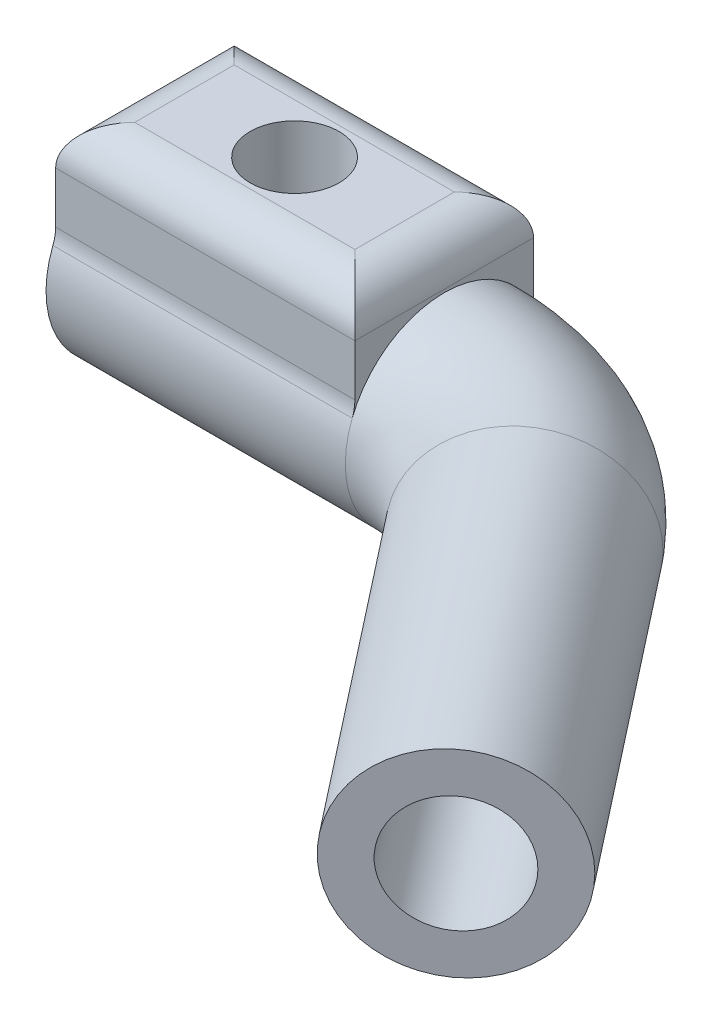
ISO-10303-21;
HEADER;
FILE_DESCRIPTION(('STEP AP214'),'2;1');
FILE_NAME('part.step','',(''),(''),'','','');
FILE_SCHEMA(('AUTOMOTIVE_DESIGN { 1 0 10303 214 1 1 1 1 }'));
ENDSEC;
DATA;
#1=APPLICATION_CONTEXT('core data for automotive mechanical design processes');
#2=APPLICATION_PROTOCOL_DEFINITION('international standard','automotive_design',2000,#1);
#3=PRODUCT_CONTEXT('',#1,'mechanical');
#4=PRODUCT('Part','Part','',(#3));
#5=PRODUCT_RELATED_PRODUCT_CATEGORY('part','',(#4));
#6=PRODUCT_DEFINITION_FORMATION('','',#4);
#7=PRODUCT_DEFINITION_CONTEXT('part definition',#1,'design');
#8=PRODUCT_DEFINITION('design','',#6,#7);
#9=PRODUCT_DEFINITION_SHAPE('','',#8);
#10=(LENGTH_UNIT() NAMED_UNIT(*) SI_UNIT(.MILLI.,.METRE.));
#11=(NAMED_UNIT(*) PLANE_ANGLE_UNIT() SI_UNIT($,.RADIAN.));
#12=(NAMED_UNIT(*) SI_UNIT($,.STERADIAN.) SOLID_ANGLE_UNIT());
#13=UNCERTAINTY_MEASURE_WITH_UNIT(LENGTH_MEASURE(1.E-05),#10,'distance_accuracy_value','');
#14=(GEOMETRIC_REPRESENTATION_CONTEXT(3) GLOBAL_UNCERTAINTY_ASSIGNED_CONTEXT((#13)) GLOBAL_UNIT_ASSIGNED_CONTEXT((#10,
#11,#12)) REPRESENTATION_CONTEXT('',''));
#15=CARTESIAN_POINT('',(0.,0.,0.));
#16=DIRECTION('',(0.,0.,1.));
#17=DIRECTION('',(1.,0.,0.));
#18=AXIS2_PLACEMENT_3D('',#15,#16,#17);
#19=CARTESIAN_POINT('',(0.,2.15,0.));
#20=DIRECTION('',(0.,1.,0.));
#21=DIRECTION('',(0.,0.,1.));
#22=AXIS2_PLACEMENT_3D('',#19,#20,#21);
#23=PLANE('',#22);
#24=DIRECTION('',(-1.,0.,0.));
#25=VECTOR('',#24,1.);
#26=CARTESIAN_POINT('',(12.5,2.15,2.16333076527839));
#27=LINE('',#26,#25);
#28=CARTESIAN_POINT('',(12.5,2.15,2.16333076527839));
#29=VERTEX_POINT('',#28);
#30=CARTESIAN_POINT('',(8.18265566248867,2.15,2.16333076527839));
#31=VERTEX_POINT('',#30);
#32=EDGE_CURVE('E155',#29,#31,#27,.T.);
#33=ORIENTED_EDGE('',*,*,#32,.T.);
#34=CARTESIAN_POINT('',(7.56418981864602,2.15,0.));
#35=DIRECTION('',(0.,1.,0.));
#36=DIRECTION('',(0.,0.,1.));
#37=AXIS2_PLACEMENT_3D('',#34,#35,#36);
#38=CIRCLE('',#37,2.25);
#39=CARTESIAN_POINT('',(8.18265566248868,2.15,-2.16333076527839));
#40=VERTEX_POINT('',#39);
#41=EDGE_CURVE('E138',#40,#31,#38,.F.);
#42=ORIENTED_EDGE('',*,*,#41,.F.);
#43=DIRECTION('',(-1.,0.,0.));
#44=VECTOR('',#43,1.);
#45=CARTESIAN_POINT('',(12.5,2.15,-2.16333076527839));
#46=LINE('',#45,#44);
#47=CARTESIAN_POINT('',(12.5,2.15,-2.16333076527839));
#48=VERTEX_POINT('',#47);
#49=EDGE_CURVE('E147',#48,#40,#46,.T.);
#50=ORIENTED_EDGE('',*,*,#49,.F.);
#51=DIRECTION('',(0.,0.,-1.));
#52=VECTOR('',#51,1.);
#53=CARTESIAN_POINT('',(12.5,2.15,-2.16333076527839));
#54=LINE('',#53,#52);
#55=EDGE_CURVE('E281',#29,#48,#54,.T.);
#56=ORIENTED_EDGE('',*,*,#55,.F.);
#57=EDGE_LOOP('',(#33,#42,#50,#56));
#58=FACE_BOUND('',#57,.T.);
#59=ADVANCED_FACE('F41',(#58),#23,.F.);
#60=CARTESIAN_POINT('',(0.,0.,0.));
#61=DIRECTION('',(1.,0.,0.));
#62=DIRECTION('',(0.,0.,-1.));
#63=AXIS2_PLACEMENT_3D('',#60,#61,#62);
#64=PLANE('',#63);
#65=DIRECTION('',(0.,-1.,0.));
#66=VECTOR('',#65,1.);
#67=CARTESIAN_POINT('',(0.,7.15,4.51414443721066));
#68=LINE('',#67,#66);
#69=CARTESIAN_POINT('',(0.,5.15,4.51414443721066));
#70=VERTEX_POINT('',#69);
#71=CARTESIAN_POINT('',(0.,2.56240555946114,4.51414443721066));
#72=VERTEX_POINT('',#71);
#73=EDGE_CURVE('E267',#70,#72,#68,.T.);
#74=ORIENTED_EDGE('',*,*,#73,.F.);
#75=DIRECTION('',(0.,0.,1.));
#76=VECTOR('',#75,1.);
#77=CARTESIAN_POINT('',(0.,5.15,-4.51414443721067));
#78=LINE('',#77,#76);
#79=CARTESIAN_POINT('',(0.,5.15,-4.51414443721067));
#80=VERTEX_POINT('',#79);
#81=EDGE_CURVE('E11',#70,#80,#78,.F.);
#82=ORIENTED_EDGE('',*,*,#81,.T.);
#83=DIRECTION('',(0.,-1.,0.));
#84=VECTOR('',#83,1.);
#85=CARTESIAN_POINT('',(0.,7.15,-4.51414443721067));
#86=LINE('',#85,#84);
#87=CARTESIAN_POINT('',(0.,2.56240555946114,-4.51414443721067));
#88=VERTEX_POINT('',#87);
#89=EDGE_CURVE('E254',#80,#88,#86,.T.);
#90=ORIENTED_EDGE('',*,*,#89,.T.);
#91=CARTESIAN_POINT('',(0.,2.56240555946114,-6.51414443721067));
#92=DIRECTION('',(1.,0.,0.));
#93=DIRECTION('',(0.,0.,-1.));
#94=AXIS2_PLACEMENT_3D('',#91,#92,#93);
#95=CIRCLE('',#94,2.);
#96=CARTESIAN_POINT('',(0.,1.83028968532938,-4.65296031229333));
#97=VERTEX_POINT('',#96);
#98=EDGE_CURVE('E197',#88,#97,#95,.T.);
#99=ORIENTED_EDGE('',*,*,#98,.T.);
#100=CARTESIAN_POINT('',(0.,0.,0.));
#101=DIRECTION('',(1.,0.,0.));
#102=DIRECTION('',(0.,0.,-1.));
#103=AXIS2_PLACEMENT_3D('',#100,#101,#102);
#104=CIRCLE('',#103,5.);
#105=CARTESIAN_POINT('',(0.,1.83028968532939,4.65296031229333));
#106=VERTEX_POINT('',#105);
#107=EDGE_CURVE('E159',#106,#97,#104,.T.);
#108=ORIENTED_EDGE('',*,*,#107,.F.);
#109=CARTESIAN_POINT('',(0.,2.56240555946114,6.51414443721066));
#110=DIRECTION('',(1.,0.,0.));
#111=DIRECTION('',(0.,0.,-1.));
#112=AXIS2_PLACEMENT_3D('',#109,#110,#111);
#113=CIRCLE('',#112,2.);
#114=EDGE_CURVE('E208',#106,#72,#113,.T.);
#115=ORIENTED_EDGE('',*,*,#114,.T.);
#116=EDGE_LOOP('',(#74,#82,#90,#99,#108,#115));
#117=FACE_BOUND('',#116,.T.);
#118=CARTESIAN_POINT('',(0.,0.,0.));
#119=DIRECTION('',(-1.,0.,0.));
#120=DIRECTION('',(0.,0.,1.));
#121=AXIS2_PLACEMENT_3D('',#118,#119,#120);
#122=CIRCLE('',#121,3.05);
#123=CARTESIAN_POINT('',(0.,2.15,-2.16333076527839));
#124=VERTEX_POINT('',#123);
#125=CARTESIAN_POINT('',(0.,2.15,2.16333076527839));
#126=VERTEX_POINT('',#125);
#127=EDGE_CURVE('E164',#124,#126,#122,.T.);
#128=ORIENTED_EDGE('',*,*,#127,.F.);
#129=DIRECTION('',(0.,0.,1.));
#130=VECTOR('',#129,1.);
#131=CARTESIAN_POINT('',(0.,2.15,-4.51414443721067));
#132=LINE('',#131,#130);
#133=EDGE_CURVE('E153',#124,#126,#132,.T.);
#134=ORIENTED_EDGE('',*,*,#133,.T.);
#135=EDGE_LOOP('',(#128,#134));
#136=FACE_BOUND('',#135,.T.);
#137=ADVANCED_FACE('F288',(#117,#136),#64,.F.);
#138=CARTESIAN_POINT('',(35.4096945094416,0.,19.686069062301));
#139=DIRECTION('',(0.616387780377665,0.,0.78744276249204));
#140=DIRECTION('',(0.78744276249204,0.,-0.616387780377665));
#141=AXIS2_PLACEMENT_3D('',#138,#139,#140);
#142=PLANE('',#141);
#143=CARTESIAN_POINT('',(35.4096945094416,0.,19.686069062301));
#144=DIRECTION('',(0.616387780377665,0.,0.78744276249204));
#145=DIRECTION('',(0.78744276249204,0.,-0.616387780377665));
#146=AXIS2_PLACEMENT_3D('',#143,#144,#145);
#147=CIRCLE('',#146,2.95);
#148=CARTESIAN_POINT('',(37.7326506587931,0.,17.8677251101869));
#149=VERTEX_POINT('',#148);
#150=EDGE_CURVE('E270',#149,#149,#147,.T.);
#151=ORIENTED_EDGE('',*,*,#150,.F.);
#152=EDGE_LOOP('',(#151));
#153=FACE_BOUND('',#152,.T.);
#154=CARTESIAN_POINT('',(35.4096945094416,0.,19.686069062301));
#155=DIRECTION('',(0.616387780377665,0.,0.78744276249204));
#156=DIRECTION('',(0.78744276249204,0.,-0.616387780377665));
#157=AXIS2_PLACEMENT_3D('',#154,#155,#156);
#158=CIRCLE('',#157,5.);
#159=CARTESIAN_POINT('',(39.3469083219018,0.,16.6041301604127));
#160=VERTEX_POINT('',#159);
#161=EDGE_CURVE('E178',#160,#160,#158,.T.);
#162=ORIENTED_EDGE('',*,*,#161,.T.);
#163=EDGE_LOOP('',(#162));
#164=FACE_BOUND('',#163,.T.);
#165=ADVANCED_FACE('F290',(#153,#164),#142,.T.);
#166=CARTESIAN_POINT('',(0.,0.,0.));
#167=DIRECTION('',(1.,0.,0.));
#168=DIRECTION('',(0.,0.,-1.));
#169=AXIS2_PLACEMENT_3D('',#166,#167,#168);
#170=CYLINDRICAL_SURFACE('',#169,5.);
#171=ORIENTED_EDGE('',*,*,#107,.T.);
#172=DIRECTION('',(1.,0.,0.));
#173=VECTOR('',#172,1.);
#174=CARTESIAN_POINT('',(0.,1.83028968532938,-4.65296031229333));
#175=LINE('',#174,#173);
#176=CARTESIAN_POINT('',(15.1283796372919,1.83028968532938,-4.65296031229333));
#177=VERTEX_POINT('',#176);
#178=EDGE_CURVE('E189',#97,#177,#175,.T.);
#179=ORIENTED_EDGE('',*,*,#178,.T.);
#180=CARTESIAN_POINT('',(15.1283796372919,0.,0.));
#181=DIRECTION('',(1.,0.,0.));
#182=DIRECTION('',(0.,0.,-1.));
#183=AXIS2_PLACEMENT_3D('',#180,#181,#182);
#184=CIRCLE('',#183,5.);
#185=CARTESIAN_POINT('',(15.1283796372919,1.83028968532939,4.65296031229333));
#186=VERTEX_POINT('',#185);
#187=EDGE_CURVE('E170',#186,#177,#184,.T.);
#188=ORIENTED_EDGE('',*,*,#187,.F.);
#189=DIRECTION('',(1.,0.,0.));
#190=VECTOR('',#189,1.);
#191=CARTESIAN_POINT('',(0.,1.83028968532939,4.65296031229333));
#192=LINE('',#191,#190);
#193=EDGE_CURVE('E186',#186,#106,#192,.F.);
#194=ORIENTED_EDGE('',*,*,#193,.T.);
#195=EDGE_LOOP('',(#171,#179,#188,#194));
#196=FACE_BOUND('',#195,.T.);
#197=ADVANCED_FACE('F297',(#196),#170,.T.);
#198=CARTESIAN_POINT('',(15.1283796372919,0.,10.));
#199=DIRECTION('',(0.,-1.,0.));
#200=DIRECTION('',(0.,0.,-1.));
#201=AXIS2_PLACEMENT_3D('',#198,#199,#200);
#202=TOROIDAL_SURFACE('',#201,10.,5.);
#203=CARTESIAN_POINT('',(23.0028072622123,0.,3.83612219622335));
#204=DIRECTION('',(0.616387780377665,0.,0.78744276249204));
#205=DIRECTION('',(0.78744276249204,0.,-0.616387780377665));
#206=AXIS2_PLACEMENT_3D('',#203,#204,#205);
#207=CIRCLE('',#206,5.);
#208=CARTESIAN_POINT('',(26.9400210746725,0.,0.754183294335029));
#209=VERTEX_POINT('',#208);
#210=EDGE_CURVE('E174',#209,#209,#207,.T.);
#211=ORIENTED_EDGE('',*,*,#210,.F.);
#212=EDGE_LOOP('',(#211));
#213=FACE_BOUND('',#212,.T.);
#214=EDGE_CURVE('E171',#177,#186,#184,.T.);
#215=ORIENTED_EDGE('',*,*,#214,.T.);
#216=ORIENTED_EDGE('',*,*,#187,.T.);
#217=EDGE_LOOP('',(#215,#216));
#218=FACE_BOUND('',#217,.T.);
#219=ADVANCED_FACE('F313',(#213,#218),#202,.T.);
#220=CARTESIAN_POINT('',(23.0028072622123,0.,3.83612219622335));
#221=DIRECTION('',(0.616387780377665,0.,0.78744276249204));
#222=DIRECTION('',(0.78744276249204,0.,-0.616387780377665));
#223=AXIS2_PLACEMENT_3D('',#220,#221,#222);
#224=CYLINDRICAL_SURFACE('',#223,5.);
#225=ORIENTED_EDGE('',*,*,#161,.F.);
#226=EDGE_LOOP('',(#225));
#227=FACE_BOUND('',#226,.T.);
#228=ORIENTED_EDGE('',*,*,#210,.T.);
#229=EDGE_LOOP('',(#228));
#230=FACE_BOUND('',#229,.T.);
#231=ADVANCED_FACE('F302',(#227,#230),#224,.T.);
#232=CARTESIAN_POINT('',(12.5,0.,0.));
#233=DIRECTION('',(-1.,0.,0.));
#234=DIRECTION('',(0.,0.,1.));
#235=AXIS2_PLACEMENT_3D('',#232,#233,#234);
#236=CYLINDRICAL_SURFACE('',#235,3.05);
#237=CARTESIAN_POINT('',(6.94572397480338,2.15,2.16333076527839));
#238=VERTEX_POINT('',#237);
#239=EDGE_CURVE('E161',#238,#126,#27,.T.);
#240=ORIENTED_EDGE('',*,*,#239,.F.);
#241=CARTESIAN_POINT('',(8.18265566248867,2.15,2.16333076527839));
#242=CARTESIAN_POINT('',(8.13982369720837,2.13767974367358,2.17557396166856));
#243=CARTESIAN_POINT('',(8.09636795681791,2.12635543925523,2.18662120503574));
#244=CARTESIAN_POINT('',(8.00831118588735,2.10603876580373,2.20619557820886));
#245=CARTESIAN_POINT('',(7.96370900241831,2.09704885395342,2.21472005385568));
#246=CARTESIAN_POINT('',(7.82879734546365,2.07418290831492,2.23622999215727));
#247=CARTESIAN_POINT('',(7.7370726310703,2.06431707738953,2.24524194456994));
#248=CARTESIAN_POINT('',(7.55222126268958,2.05707748638961,2.25188012805324));
#249=CARTESIAN_POINT('',(7.45908962063703,2.059774456072,2.24944189285532));
#250=CARTESIAN_POINT('',(7.27510229776286,2.07729987196947,2.23325997608356));
#251=CARTESIAN_POINT('',(7.18424402017978,2.09211375819944,2.21952986299983));
#252=CARTESIAN_POINT('',(7.07030616779168,2.11737991023387,2.19528124516197));
#253=CARTESIAN_POINT('',(7.04508952180657,2.12341119609185,2.18945272479026));
#254=CARTESIAN_POINT('',(6.99509175370004,2.13618686647158,2.17699026009721));
#255=CARTESIAN_POINT('',(6.97030990223976,2.14292988974252,2.17035784979548));
#256=CARTESIAN_POINT('',(6.94572397480338,2.15,2.16333076527839));
#257=B_SPLINE_CURVE_WITH_KNOTS('',3,(#241,#242,#243,#244,#245,#246,#247,#248,#249,#250,#251,
#252,#253,#254,#255,#256),.UNSPECIFIED.,.F.,.F.,(4,2,2,2,2,2,2,4),(0.,0.138608579889265,
0.277362473174993,0.55387360306665,0.831943392392581,1.10967953623802,1.18939155284372,
1.26895378579073),.UNSPECIFIED.);
#258=EDGE_CURVE('E59',#31,#238,#257,.T.);
#259=ORIENTED_EDGE('',*,*,#258,.F.);
#260=ORIENTED_EDGE('',*,*,#32,.F.);
#261=CARTESIAN_POINT('',(12.5,0.,0.));
#262=DIRECTION('',(-1.,0.,0.));
#263=DIRECTION('',(0.,0.,1.));
#264=AXIS2_PLACEMENT_3D('',#261,#262,#263);
#265=CIRCLE('',#264,3.05);
#266=EDGE_CURVE('E278',#48,#29,#265,.T.);
#267=ORIENTED_EDGE('',*,*,#266,.F.);
#268=ORIENTED_EDGE('',*,*,#49,.T.);
#269=CARTESIAN_POINT('',(6.94572397480337,2.15,-2.16333076527839));
#270=CARTESIAN_POINT('',(6.98855594008367,2.13767974367358,-2.17557396166856));
#271=CARTESIAN_POINT('',(7.03201168047413,2.12635543925523,-2.18662120503574));
#272=CARTESIAN_POINT('',(7.12006845140469,2.10603876580373,-2.20619557820886));
#273=CARTESIAN_POINT('',(7.16467063487373,2.09704885395342,-2.21472005385568));
#274=CARTESIAN_POINT('',(7.29958229182839,2.07418290831491,-2.23622999215727));
#275=CARTESIAN_POINT('',(7.39130700622174,2.06431707738953,-2.24524194456995));
#276=CARTESIAN_POINT('',(7.57615837460246,2.0570774863896,-2.25188012805324));
#277=CARTESIAN_POINT('',(7.66929001665501,2.059774456072,-2.24944189285532));
#278=CARTESIAN_POINT('',(7.85327733952918,2.07729987196947,-2.23325997608356));
#279=CARTESIAN_POINT('',(7.94413561711225,2.09211375819944,-2.21952986299984));
#280=CARTESIAN_POINT('',(8.05807346950036,2.11737991023386,-2.19528124516197));
#281=CARTESIAN_POINT('',(8.08329011548547,2.12341119609184,-2.18945272479027));
#282=CARTESIAN_POINT('',(8.13328788359201,2.13618686647158,-2.17699026009721));
#283=CARTESIAN_POINT('',(8.15806973505229,2.14292988974252,-2.17035784979548));
#284=CARTESIAN_POINT('',(8.18265566248868,2.15,-2.16333076527839));
#285=B_SPLINE_CURVE_WITH_KNOTS('',3,(#269,#270,#271,#272,#273,#274,#275,#276,#277,#278,#279,
#280,#281,#282,#283,#284),.UNSPECIFIED.,.F.,.F.,(4,2,2,2,2,2,2,4),(0.,0.138608579889265,
0.277362473174994,0.55387360306665,0.831943392392583,1.10967953623802,1.18939155284374,
1.26895378579075),.UNSPECIFIED.);
#286=CARTESIAN_POINT('',(6.94572397480337,2.15,-2.16333076527839));
#287=VERTEX_POINT('',#286);
#288=EDGE_CURVE('E132',#287,#40,#285,.T.);
#289=ORIENTED_EDGE('',*,*,#288,.F.);
#290=EDGE_CURVE('E144',#287,#124,#46,.T.);
#291=ORIENTED_EDGE('',*,*,#290,.T.);
#292=ORIENTED_EDGE('',*,*,#127,.T.);
#293=EDGE_LOOP('',(#240,#259,#260,#267,#268,#289,#291,#292));
#294=FACE_BOUND('',#293,.T.);
#295=ADVANCED_FACE('F142',(#294),#236,.F.);
#296=CARTESIAN_POINT('',(12.5,0.,0.));
#297=DIRECTION('',(-1.,0.,0.));
#298=DIRECTION('',(0.,0.,1.));
#299=AXIS2_PLACEMENT_3D('',#296,#297,#298);
#300=PLANE('',#299);
#301=ORIENTED_EDGE('',*,*,#266,.T.);
#302=ORIENTED_EDGE('',*,*,#55,.T.);
#303=EDGE_LOOP('',(#301,#302));
#304=FACE_BOUND('',#303,.T.);
#305=ADVANCED_FACE('F305',(#304),#300,.T.);
#306=CARTESIAN_POINT('',(29.245816705665,0.,11.8116414373806));
#307=DIRECTION('',(0.616387780377665,0.,0.78744276249204));
#308=DIRECTION('',(0.78744276249204,0.,-0.616387780377665));
#309=AXIS2_PLACEMENT_3D('',#306,#307,#308);
#310=CYLINDRICAL_SURFACE('',#309,2.95);
#311=CARTESIAN_POINT('',(29.245816705665,0.,11.8116414373806));
#312=DIRECTION('',(0.616387780377665,0.,0.78744276249204));
#313=DIRECTION('',(0.78744276249204,0.,-0.616387780377665));
#314=AXIS2_PLACEMENT_3D('',#311,#312,#313);
#315=CIRCLE('',#314,2.95);
#316=CARTESIAN_POINT('',(31.5687728550165,0.,9.9932974852665));
#317=VERTEX_POINT('',#316);
#318=EDGE_CURVE('E271',#317,#317,#315,.T.);
#319=ORIENTED_EDGE('',*,*,#318,.F.);
#320=EDGE_LOOP('',(#319));
#321=FACE_BOUND('',#320,.T.);
#322=ORIENTED_EDGE('',*,*,#150,.T.);
#323=EDGE_LOOP('',(#322));
#324=FACE_BOUND('',#323,.T.);
#325=ADVANCED_FACE('F311',(#321,#324),#310,.F.);
#326=CARTESIAN_POINT('',(29.245816705665,0.,11.8116414373806));
#327=DIRECTION('',(0.616387780377665,0.,0.78744276249204));
#328=DIRECTION('',(0.78744276249204,0.,-0.616387780377665));
#329=AXIS2_PLACEMENT_3D('',#326,#327,#328);
#330=PLANE('',#329);
#331=ORIENTED_EDGE('',*,*,#318,.T.);
#332=EDGE_LOOP('',(#331));
#333=FACE_BOUND('',#332,.T.);
#334=ADVANCED_FACE('F387',(#333),#330,.T.);
#335=ORIENTED_EDGE('',*,*,#290,.F.);
#336=EDGE_CURVE('E129',#238,#287,#38,.F.);
#337=ORIENTED_EDGE('',*,*,#336,.F.);
#338=ORIENTED_EDGE('',*,*,#239,.T.);
#339=ORIENTED_EDGE('',*,*,#133,.F.);
#340=EDGE_LOOP('',(#335,#337,#338,#339));
#341=FACE_BOUND('',#340,.T.);
#342=ADVANCED_FACE('F151',(#341),#23,.F.);
#343=CARTESIAN_POINT('',(0.,7.15,4.51414443721066));
#344=DIRECTION('',(0.,0.,-1.));
#345=DIRECTION('',(-1.,0.,0.));
#346=AXIS2_PLACEMENT_3D('',#343,#344,#345);
#347=PLANE('',#346);
#348=DIRECTION('',(0.,-1.,0.));
#349=VECTOR('',#348,1.);
#350=CARTESIAN_POINT('',(15.128379637292,7.15,4.51414443721066));
#351=LINE('',#350,#349);
#352=CARTESIAN_POINT('',(15.128379637292,5.15,4.51414443721066));
#353=VERTEX_POINT('',#352);
#354=CARTESIAN_POINT('',(15.128379637292,2.56240555946114,4.51414443721066));
#355=VERTEX_POINT('',#354);
#356=EDGE_CURVE('E264',#353,#355,#351,.T.);
#357=ORIENTED_EDGE('',*,*,#356,.F.);
#358=DIRECTION('',(1.,0.,0.));
#359=VECTOR('',#358,1.);
#360=CARTESIAN_POINT('',(0.,5.15,4.51414443721066));
#361=LINE('',#360,#359);
#362=EDGE_CURVE('E51',#353,#70,#361,.F.);
#363=ORIENTED_EDGE('',*,*,#362,.T.);
#364=ORIENTED_EDGE('',*,*,#73,.T.);
#365=DIRECTION('',(1.,0.,0.));
#366=VECTOR('',#365,1.);
#367=CARTESIAN_POINT('',(0.,2.56240555946114,4.51414443721066));
#368=LINE('',#367,#366);
#369=EDGE_CURVE('E193',#72,#355,#368,.T.);
#370=ORIENTED_EDGE('',*,*,#369,.T.);
#371=EDGE_LOOP('',(#357,#363,#364,#370));
#372=FACE_BOUND('',#371,.T.);
#373=ADVANCED_FACE('F386',(#372),#347,.F.);
#374=CARTESIAN_POINT('',(15.128379637292,7.15,-4.51414443721067));
#375=DIRECTION('',(-1.,0.,0.));
#376=DIRECTION('',(0.,0.,1.));
#377=AXIS2_PLACEMENT_3D('',#374,#375,#376);
#378=PLANE('',#377);
#379=DIRECTION('',(0.,-1.,0.));
#380=VECTOR('',#379,1.);
#381=CARTESIAN_POINT('',(15.128379637292,7.15,-4.51414443721067));
#382=LINE('',#381,#380);
#383=CARTESIAN_POINT('',(15.128379637292,5.15,-4.51414443721067));
#384=VERTEX_POINT('',#383);
#385=CARTESIAN_POINT('',(15.128379637292,2.56240555946114,-4.51414443721067));
#386=VERTEX_POINT('',#385);
#387=EDGE_CURVE('E258',#384,#386,#382,.T.);
#388=ORIENTED_EDGE('',*,*,#387,.F.);
#389=DIRECTION('',(0.,0.,-1.));
#390=VECTOR('',#389,1.);
#391=CARTESIAN_POINT('',(15.128379637292,5.15,4.51414443721066));
#392=LINE('',#391,#390);
#393=EDGE_CURVE('E229',#384,#353,#392,.F.);
#394=ORIENTED_EDGE('',*,*,#393,.T.);
#395=ORIENTED_EDGE('',*,*,#356,.T.);
#396=CARTESIAN_POINT('',(15.128379637292,2.56240555946114,6.51414443721066));
#397=DIRECTION('',(-1.,0.,0.));
#398=DIRECTION('',(0.,0.,1.));
#399=AXIS2_PLACEMENT_3D('',#396,#397,#398);
#400=CIRCLE('',#399,2.);
#401=EDGE_CURVE('E204',#355,#186,#400,.T.);
#402=ORIENTED_EDGE('',*,*,#401,.T.);
#403=ORIENTED_EDGE('',*,*,#214,.F.);
#404=CARTESIAN_POINT('',(15.128379637292,2.56240555946114,-6.51414443721067));
#405=DIRECTION('',(-1.,0.,0.));
#406=DIRECTION('',(0.,0.,1.));
#407=AXIS2_PLACEMENT_3D('',#404,#405,#406);
#408=CIRCLE('',#407,2.);
#409=EDGE_CURVE('E200',#177,#386,#408,.T.);
#410=ORIENTED_EDGE('',*,*,#409,.T.);
#411=EDGE_LOOP('',(#388,#394,#395,#402,#403,#410));
#412=FACE_BOUND('',#411,.T.);
#413=ADVANCED_FACE('F337',(#412),#378,.F.);
#414=CARTESIAN_POINT('',(0.,7.15,-4.51414443721067));
#415=DIRECTION('',(0.,0.,1.));
#416=DIRECTION('',(1.,0.,0.));
#417=AXIS2_PLACEMENT_3D('',#414,#415,#416);
#418=PLANE('',#417);
#419=ORIENTED_EDGE('',*,*,#89,.F.);
#420=DIRECTION('',(-1.,0.,0.));
#421=VECTOR('',#420,1.);
#422=CARTESIAN_POINT('',(15.128379637292,5.15,-4.51414443721067));
#423=LINE('',#422,#421);
#424=EDGE_CURVE('E225',#80,#384,#423,.F.);
#425=ORIENTED_EDGE('',*,*,#424,.T.);
#426=ORIENTED_EDGE('',*,*,#387,.T.);
#427=DIRECTION('',(1.,0.,0.));
#428=VECTOR('',#427,1.);
#429=CARTESIAN_POINT('',(0.,2.56240555946114,-4.51414443721067));
#430=LINE('',#429,#428);
#431=EDGE_CURVE('E182',#386,#88,#430,.F.);
#432=ORIENTED_EDGE('',*,*,#431,.T.);
#433=EDGE_LOOP('',(#419,#425,#426,#432));
#434=FACE_BOUND('',#433,.T.);
#435=ADVANCED_FACE('F348',(#434),#418,.F.);
#436=CARTESIAN_POINT('',(0.,7.15,0.));
#437=DIRECTION('',(0.,1.,0.));
#438=DIRECTION('',(0.,0.,1.));
#439=AXIS2_PLACEMENT_3D('',#436,#437,#438);
#440=PLANE('',#439);
#441=CARTESIAN_POINT('',(7.56418981864602,7.15,0.));
#442=DIRECTION('',(0.,1.,0.));
#443=DIRECTION('',(0.,0.,1.));
#444=AXIS2_PLACEMENT_3D('',#441,#442,#443);
#445=CIRCLE('',#444,2.25);
#446=CARTESIAN_POINT('',(7.56418981864602,7.15,2.25));
#447=VERTEX_POINT('',#446);
#448=EDGE_CURVE('E238',#447,#447,#445,.T.);
#449=ORIENTED_EDGE('',*,*,#448,.F.);
#450=EDGE_LOOP('',(#449));
#451=FACE_BOUND('',#450,.T.);
#452=DIRECTION('',(0.,0.,-1.));
#453=VECTOR('',#452,1.);
#454=CARTESIAN_POINT('',(13.128379637292,7.15,-4.51414443721067));
#455=LINE('',#454,#453);
#456=CARTESIAN_POINT('',(13.128379637292,7.15,2.51414443721066));
#457=VERTEX_POINT('',#456);
#458=CARTESIAN_POINT('',(13.128379637292,7.15,-2.51414443721067));
#459=VERTEX_POINT('',#458);
#460=EDGE_CURVE('E218',#457,#459,#455,.T.);
#461=ORIENTED_EDGE('',*,*,#460,.T.);
#462=DIRECTION('',(-1.,0.,0.));
#463=VECTOR('',#462,1.);
#464=CARTESIAN_POINT('',(0.,7.15,-2.51414443721067));
#465=LINE('',#464,#463);
#466=CARTESIAN_POINT('',(2.,7.15,-2.51414443721067));
#467=VERTEX_POINT('',#466);
#468=EDGE_CURVE('E221',#459,#467,#465,.T.);
#469=ORIENTED_EDGE('',*,*,#468,.T.);
#470=DIRECTION('',(0.,0.,1.));
#471=VECTOR('',#470,1.);
#472=CARTESIAN_POINT('',(2.,7.15,4.51414443721066));
#473=LINE('',#472,#471);
#474=CARTESIAN_POINT('',(2.,7.15,2.51414443721066));
#475=VERTEX_POINT('',#474);
#476=EDGE_CURVE('E212',#467,#475,#473,.T.);
#477=ORIENTED_EDGE('',*,*,#476,.T.);
#478=DIRECTION('',(1.,0.,0.));
#479=VECTOR('',#478,1.);
#480=CARTESIAN_POINT('',(15.128379637292,7.15,2.51414443721066));
#481=LINE('',#480,#479);
#482=EDGE_CURVE('E215',#475,#457,#481,.T.);
#483=ORIENTED_EDGE('',*,*,#482,.T.);
#484=EDGE_LOOP('',(#461,#469,#477,#483));
#485=FACE_BOUND('',#484,.T.);
#486=ADVANCED_FACE('F358',(#451,#485),#440,.T.);
#487=CARTESIAN_POINT('',(0.,2.56240555946114,-6.51414443721067));
#488=DIRECTION('',(1.,0.,0.));
#489=DIRECTION('',(0.,0.,-1.));
#490=AXIS2_PLACEMENT_3D('',#487,#488,#489);
#491=CYLINDRICAL_SURFACE('',#490,2.);
#492=ORIENTED_EDGE('',*,*,#409,.F.);
#493=ORIENTED_EDGE('',*,*,#178,.F.);
#494=ORIENTED_EDGE('',*,*,#98,.F.);
#495=ORIENTED_EDGE('',*,*,#431,.F.);
#496=EDGE_LOOP('',(#492,#493,#494,#495));
#497=FACE_BOUND('',#496,.T.);
#498=ADVANCED_FACE('F344',(#497),#491,.F.);
#499=CARTESIAN_POINT('',(0.,2.56240555946114,6.51414443721066));
#500=DIRECTION('',(1.,0.,0.));
#501=DIRECTION('',(0.,0.,-1.));
#502=AXIS2_PLACEMENT_3D('',#499,#500,#501);
#503=CYLINDRICAL_SURFACE('',#502,2.);
#504=ORIENTED_EDGE('',*,*,#114,.F.);
#505=ORIENTED_EDGE('',*,*,#193,.F.);
#506=ORIENTED_EDGE('',*,*,#401,.F.);
#507=ORIENTED_EDGE('',*,*,#369,.F.);
#508=EDGE_LOOP('',(#504,#505,#506,#507));
#509=FACE_BOUND('',#508,.T.);
#510=ADVANCED_FACE('F341',(#509),#503,.F.);
#511=CARTESIAN_POINT('',(0.,5.15,2.51414443721066));
#512=DIRECTION('',(-1.,0.,0.));
#513=DIRECTION('',(0.,0.,1.));
#514=AXIS2_PLACEMENT_3D('',#511,#512,#513);
#515=CYLINDRICAL_SURFACE('',#514,2.);
#516=CARTESIAN_POINT('',(2.,5.15,2.51414443721066));
#517=DIRECTION('',(-0.707106781186547,0.,-0.707106781186547));
#518=DIRECTION('',(0.707106781186547,0.,-0.707106781186547));
#519=AXIS2_PLACEMENT_3D('',#516,#517,#518);
#520=ELLIPSE('',#519,2.82842712474619,2.);
#521=EDGE_CURVE('E240',#70,#475,#520,.T.);
#522=ORIENTED_EDGE('',*,*,#521,.F.);
#523=ORIENTED_EDGE('',*,*,#362,.F.);
#524=CARTESIAN_POINT('',(13.128379637292,5.15,2.51414443721066));
#525=DIRECTION('',(-0.707106781186547,0.,0.707106781186547));
#526=DIRECTION('',(-0.707106781186547,0.,-0.707106781186547));
#527=AXIS2_PLACEMENT_3D('',#524,#525,#526);
#528=ELLIPSE('',#527,2.82842712474619,2.);
#529=EDGE_CURVE('E45',#457,#353,#528,.F.);
#530=ORIENTED_EDGE('',*,*,#529,.F.);
#531=ORIENTED_EDGE('',*,*,#482,.F.);
#532=EDGE_LOOP('',(#522,#523,#530,#531));
#533=FACE_BOUND('',#532,.T.);
#534=ADVANCED_FACE('F43',(#533),#515,.T.);
#535=CARTESIAN_POINT('',(13.128379637292,5.15,0.));
#536=DIRECTION('',(0.,0.,1.));
#537=DIRECTION('',(1.,0.,0.));
#538=AXIS2_PLACEMENT_3D('',#535,#536,#537);
#539=CYLINDRICAL_SURFACE('',#538,2.);
#540=ORIENTED_EDGE('',*,*,#529,.T.);
#541=ORIENTED_EDGE('',*,*,#393,.F.);
#542=CARTESIAN_POINT('',(13.128379637292,5.15,-2.51414443721067));
#543=DIRECTION('',(0.707106781186547,0.,0.707106781186547));
#544=DIRECTION('',(-0.707106781186547,0.,0.707106781186547));
#545=AXIS2_PLACEMENT_3D('',#542,#543,#544);
#546=ELLIPSE('',#545,2.82842712474619,2.);
#547=EDGE_CURVE('E237',#459,#384,#546,.F.);
#548=ORIENTED_EDGE('',*,*,#547,.F.);
#549=ORIENTED_EDGE('',*,*,#460,.F.);
#550=EDGE_LOOP('',(#540,#541,#548,#549));
#551=FACE_BOUND('',#550,.T.);
#552=ADVANCED_FACE('F359',(#551),#539,.T.);
#553=CARTESIAN_POINT('',(2.,5.15,0.));
#554=DIRECTION('',(0.,0.,-1.));
#555=DIRECTION('',(-1.,0.,0.));
#556=AXIS2_PLACEMENT_3D('',#553,#554,#555);
#557=CYLINDRICAL_SURFACE('',#556,2.);
#558=ORIENTED_EDGE('',*,*,#521,.T.);
#559=ORIENTED_EDGE('',*,*,#476,.F.);
#560=CARTESIAN_POINT('',(2.,5.15,-2.51414443721067));
#561=DIRECTION('',(0.707106781186547,0.,-0.707106781186547));
#562=DIRECTION('',(-0.707106781186547,0.,-0.707106781186547));
#563=AXIS2_PLACEMENT_3D('',#560,#561,#562);
#564=ELLIPSE('',#563,2.82842712474619,2.);
#565=EDGE_CURVE('E234',#80,#467,#564,.T.);
#566=ORIENTED_EDGE('',*,*,#565,.F.);
#567=ORIENTED_EDGE('',*,*,#81,.F.);
#568=EDGE_LOOP('',(#558,#559,#566,#567));
#569=FACE_BOUND('',#568,.T.);
#570=ADVANCED_FACE('F355',(#569),#557,.T.);
#571=CARTESIAN_POINT('',(0.,5.15,-2.51414443721067));
#572=DIRECTION('',(1.,0.,0.));
#573=DIRECTION('',(0.,0.,-1.));
#574=AXIS2_PLACEMENT_3D('',#571,#572,#573);
#575=CYLINDRICAL_SURFACE('',#574,2.);
#576=ORIENTED_EDGE('',*,*,#547,.T.);
#577=ORIENTED_EDGE('',*,*,#424,.F.);
#578=ORIENTED_EDGE('',*,*,#565,.T.);
#579=ORIENTED_EDGE('',*,*,#468,.F.);
#580=EDGE_LOOP('',(#576,#577,#578,#579));
#581=FACE_BOUND('',#580,.T.);
#582=ADVANCED_FACE('F352',(#581),#575,.T.);
#583=CARTESIAN_POINT('',(7.56418981864602,-5.001,0.));
#584=DIRECTION('',(0.,1.,0.));
#585=DIRECTION('',(0.,0.,1.));
#586=AXIS2_PLACEMENT_3D('',#583,#584,#585);
#587=CYLINDRICAL_SURFACE('',#586,2.25);
#588=ORIENTED_EDGE('',*,*,#448,.T.);
#589=EDGE_LOOP('',(#588));
#590=FACE_BOUND('',#589,.T.);
#591=ORIENTED_EDGE('',*,*,#336,.T.);
#592=ORIENTED_EDGE('',*,*,#288,.T.);
#593=ORIENTED_EDGE('',*,*,#41,.T.);
#594=ORIENTED_EDGE('',*,*,#258,.T.);
#595=EDGE_LOOP('',(#591,#592,#593,#594));
#596=FACE_BOUND('',#595,.T.);
#597=ADVANCED_FACE('F131',(#590,#596),#587,.F.);
#598=CLOSED_SHELL('',(#59,#137,#165,#197,#219,#231,#295,#305,#325,#334,#342,#373,#413,#435,#486,
#498,#510,#534,#552,#570,#582,#597));
#599=MANIFOLD_SOLID_BREP('B2',#598);
#600=ADVANCED_BREP_SHAPE_REPRESENTATION('',(#18,#599),#14);
#601=SHAPE_DEFINITION_REPRESENTATION(#9,#600);
ENDSEC;
END-ISO-10303-21;
